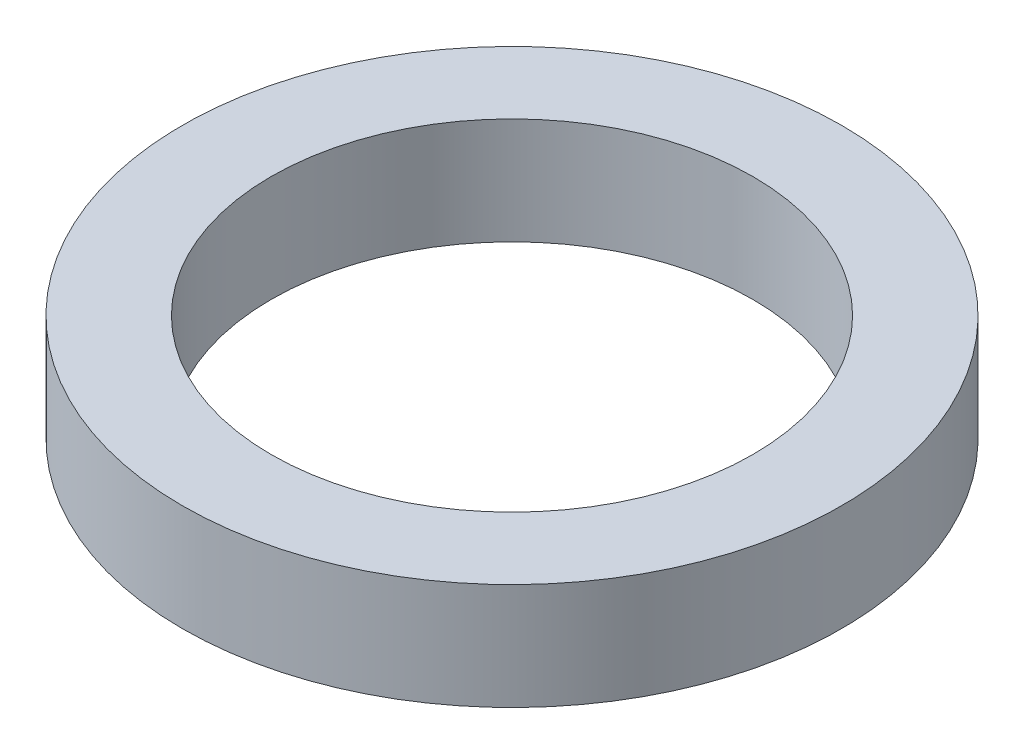
ISO-10303-21;
HEADER;
FILE_DESCRIPTION(('STEP AP214'),'2;1');
FILE_NAME('part.step','',(''),(''),'','','');
FILE_SCHEMA(('AUTOMOTIVE_DESIGN { 1 0 10303 214 1 1 1 1 }'));
ENDSEC;
DATA;
#1=APPLICATION_CONTEXT('core data for automotive mechanical design processes');
#2=APPLICATION_PROTOCOL_DEFINITION('international standard','automotive_design',2000,#1);
#3=PRODUCT_CONTEXT('',#1,'mechanical');
#4=PRODUCT('Part','Part','',(#3));
#5=PRODUCT_RELATED_PRODUCT_CATEGORY('part','',(#4));
#6=PRODUCT_DEFINITION_FORMATION('','',#4);
#7=PRODUCT_DEFINITION_CONTEXT('part definition',#1,'design');
#8=PRODUCT_DEFINITION('design','',#6,#7);
#9=PRODUCT_DEFINITION_SHAPE('','',#8);
#10=(LENGTH_UNIT() NAMED_UNIT(*) SI_UNIT(.MILLI.,.METRE.));
#11=(NAMED_UNIT(*) PLANE_ANGLE_UNIT() SI_UNIT($,.RADIAN.));
#12=(NAMED_UNIT(*) SI_UNIT($,.STERADIAN.) SOLID_ANGLE_UNIT());
#13=UNCERTAINTY_MEASURE_WITH_UNIT(LENGTH_MEASURE(1.E-05),#10,'distance_accuracy_value','');
#14=(GEOMETRIC_REPRESENTATION_CONTEXT(3) GLOBAL_UNCERTAINTY_ASSIGNED_CONTEXT((#13)) GLOBAL_UNIT_ASSIGNED_CONTEXT((#10,
#11,#12)) REPRESENTATION_CONTEXT('',''));
#15=CARTESIAN_POINT('',(0.,0.,0.));
#16=DIRECTION('',(0.,0.,1.));
#17=DIRECTION('',(1.,0.,0.));
#18=AXIS2_PLACEMENT_3D('',#15,#16,#17);
#19=CARTESIAN_POINT('',(0.,21.,0.));
#20=DIRECTION('',(0.,-1.,0.));
#21=DIRECTION('',(0.,0.,-1.));
#22=AXIS2_PLACEMENT_3D('',#19,#20,#21);
#23=CYLINDRICAL_SURFACE('',#22,65.);
#24=CARTESIAN_POINT('',(0.,21.,0.));
#25=DIRECTION('',(0.,1.,0.));
#26=DIRECTION('',(0.,0.,1.));
#27=AXIS2_PLACEMENT_3D('',#24,#25,#26);
#28=CIRCLE('',#27,65.);
#29=CARTESIAN_POINT('',(0.,21.,-65.));
#30=VERTEX_POINT('',#29);
#31=EDGE_CURVE('E10',#30,#30,#28,.T.);
#32=CARTESIAN_POINT('',(0.,0.,0.));
#33=DIRECTION('',(0.,1.,0.));
#34=DIRECTION('',(0.,0.,1.));
#35=AXIS2_PLACEMENT_3D('',#32,#33,#34);
#36=CIRCLE('',#35,65.);
#37=CARTESIAN_POINT('',(0.,0.,-65.));
#38=VERTEX_POINT('',#37);
#39=EDGE_CURVE('E37',#38,#38,#36,.T.);
#40=CARTESIAN_POINT('',(0.,21.,-65.));
#41=CARTESIAN_POINT('',(0.,20.78125,-65.));
#42=CARTESIAN_POINT('',(0.,20.5625,-65.));
#43=CARTESIAN_POINT('',(0.,20.125,-65.));
#44=CARTESIAN_POINT('',(0.,19.90625,-65.));
#45=CARTESIAN_POINT('',(0.,19.46875,-65.));
#46=CARTESIAN_POINT('',(0.,19.25,-65.));
#47=CARTESIAN_POINT('',(0.,18.8125,-65.));
#48=CARTESIAN_POINT('',(0.,18.59375,-65.));
#49=CARTESIAN_POINT('',(0.,18.15625,-65.));
#50=CARTESIAN_POINT('',(0.,17.9375,-65.));
#51=CARTESIAN_POINT('',(0.,17.5,-65.));
#52=CARTESIAN_POINT('',(0.,17.28125,-65.));
#53=CARTESIAN_POINT('',(0.,16.84375,-65.));
#54=CARTESIAN_POINT('',(0.,16.625,-65.));
#55=CARTESIAN_POINT('',(0.,16.1875,-65.));
#56=CARTESIAN_POINT('',(0.,15.96875,-65.));
#57=CARTESIAN_POINT('',(0.,15.53125,-65.));
#58=CARTESIAN_POINT('',(0.,15.3125,-65.));
#59=CARTESIAN_POINT('',(0.,14.875,-65.));
#60=CARTESIAN_POINT('',(0.,14.65625,-65.));
#61=CARTESIAN_POINT('',(0.,14.21875,-65.));
#62=CARTESIAN_POINT('',(0.,14.,-65.));
#63=CARTESIAN_POINT('',(0.,13.5625,-65.));
#64=CARTESIAN_POINT('',(0.,13.34375,-65.));
#65=CARTESIAN_POINT('',(0.,12.90625,-65.));
#66=CARTESIAN_POINT('',(0.,12.6875,-65.));
#67=CARTESIAN_POINT('',(0.,12.25,-65.));
#68=CARTESIAN_POINT('',(0.,12.03125,-65.));
#69=CARTESIAN_POINT('',(0.,11.59375,-65.));
#70=CARTESIAN_POINT('',(0.,11.375,-65.));
#71=CARTESIAN_POINT('',(0.,10.9375,-65.));
#72=CARTESIAN_POINT('',(0.,10.71875,-65.));
#73=CARTESIAN_POINT('',(0.,10.28125,-65.));
#74=CARTESIAN_POINT('',(0.,10.0625,-65.));
#75=CARTESIAN_POINT('',(0.,9.625,-65.));
#76=CARTESIAN_POINT('',(0.,9.40625,-65.));
#77=CARTESIAN_POINT('',(0.,8.96875,-65.));
#78=CARTESIAN_POINT('',(0.,8.75,-65.));
#79=CARTESIAN_POINT('',(0.,8.3125,-65.));
#80=CARTESIAN_POINT('',(0.,8.09375,-65.));
#81=CARTESIAN_POINT('',(0.,7.65625,-65.));
#82=CARTESIAN_POINT('',(0.,7.4375,-65.));
#83=CARTESIAN_POINT('',(0.,7.,-65.));
#84=CARTESIAN_POINT('',(0.,6.78125,-65.));
#85=CARTESIAN_POINT('',(0.,6.34375,-65.));
#86=CARTESIAN_POINT('',(0.,6.125,-65.));
#87=CARTESIAN_POINT('',(0.,5.6875,-65.));
#88=CARTESIAN_POINT('',(0.,5.46875,-65.));
#89=CARTESIAN_POINT('',(0.,5.03125,-65.));
#90=CARTESIAN_POINT('',(0.,4.8125,-65.));
#91=CARTESIAN_POINT('',(0.,4.375,-65.));
#92=CARTESIAN_POINT('',(0.,4.15625,-65.));
#93=CARTESIAN_POINT('',(0.,3.71875,-65.));
#94=CARTESIAN_POINT('',(0.,3.5,-65.));
#95=CARTESIAN_POINT('',(0.,3.0625,-65.));
#96=CARTESIAN_POINT('',(0.,2.84375,-65.));
#97=CARTESIAN_POINT('',(0.,2.40625,-65.));
#98=CARTESIAN_POINT('',(0.,2.1875,-65.));
#99=CARTESIAN_POINT('',(0.,1.75,-65.));
#100=CARTESIAN_POINT('',(0.,1.53125,-65.));
#101=CARTESIAN_POINT('',(0.,1.09375,-65.));
#102=CARTESIAN_POINT('',(0.,0.875000000000001,-65.));
#103=CARTESIAN_POINT('',(0.,0.4375,-65.));
#104=CARTESIAN_POINT('',(0.,0.21875,-65.));
#105=CARTESIAN_POINT('',(0.,0.,-65.));
#106=B_SPLINE_CURVE_WITH_KNOTS('',3,(#40,#41,#42,#43,#44,#45,#46,#47,#48,#49,#50,#51,#52,#53,
#54,#55,#56,#57,#58,#59,#60,#61,#62,#63,#64,#65,#66,#67,#68,#69,#70,#71,#72,#73,#74,#75,#76,#77,
#78,#79,#80,#81,#82,#83,#84,#85,#86,#87,#88,#89,#90,#91,#92,#93,#94,#95,#96,#97,#98,#99,#100,
#101,#102,#103,#104,#105),.UNSPECIFIED.,.F.,.F.,(4,2,2,2,2,2,2,2,2,2,2,2,2,2,2,2,2,2,2,2,2,2,2,
2,2,2,2,2,2,2,2,2,4),(0.,0.656249999999997,1.3125,1.96875,2.625,3.28125,3.9375,4.59375,5.25,
5.90625,6.5625,7.21875,7.875,8.53125,9.1875,9.84375,10.5,11.15625,11.8125,12.46875,13.125,
13.78125,14.4375,15.09375,15.75,16.40625,17.0625,17.71875,18.375,19.03125,19.6875,20.34375,21.),.UNSPECIFIED.);
#107=EDGE_CURVE('BSEAM40',#30,#38,#106,.T.);
#108=ORIENTED_EDGE('',*,*,#31,.F.);
#109=ORIENTED_EDGE('',*,*,#39,.T.);
#110=ORIENTED_EDGE('',*,*,#107,.T.);
#111=ORIENTED_EDGE('',*,*,#107,.F.);
#112=EDGE_LOOP('',(#108,#110,#109,#111));
#113=FACE_BOUND('',#112,.T.);
#114=ADVANCED_FACE('F40',(#113),#23,.T.);
#115=CARTESIAN_POINT('',(0.,21.,0.));
#116=DIRECTION('',(0.,1.,0.));
#117=DIRECTION('',(0.,0.,1.));
#118=AXIS2_PLACEMENT_3D('',#115,#116,#117);
#119=PLANE('',#118);
#120=CARTESIAN_POINT('',(0.,21.,0.));
#121=DIRECTION('',(0.,1.,0.));
#122=DIRECTION('',(0.,0.,1.));
#123=AXIS2_PLACEMENT_3D('',#120,#121,#122);
#124=CIRCLE('',#123,47.5);
#125=CARTESIAN_POINT('',(0.,21.,-47.5));
#126=VERTEX_POINT('',#125);
#127=EDGE_CURVE('E50',#126,#126,#124,.T.);
#128=ORIENTED_EDGE('',*,*,#127,.F.);
#129=EDGE_LOOP('',(#128));
#130=FACE_BOUND('',#129,.T.);
#131=ORIENTED_EDGE('',*,*,#31,.T.);
#132=EDGE_LOOP('',(#131));
#133=FACE_BOUND('',#132,.T.);
#134=ADVANCED_FACE('F59',(#130,#133),#119,.T.);
#135=CARTESIAN_POINT('',(0.,0.,0.));
#136=DIRECTION('',(0.,1.,0.));
#137=DIRECTION('',(0.,0.,1.));
#138=AXIS2_PLACEMENT_3D('',#135,#136,#137);
#139=PLANE('',#138);
#140=CARTESIAN_POINT('',(0.,0.,0.));
#141=DIRECTION('',(0.,1.,0.));
#142=DIRECTION('',(0.,0.,1.));
#143=AXIS2_PLACEMENT_3D('',#140,#141,#142);
#144=CIRCLE('',#143,47.5);
#145=CARTESIAN_POINT('',(0.,0.,-47.5));
#146=VERTEX_POINT('',#145);
#147=EDGE_CURVE('E47',#146,#146,#144,.T.);
#148=ORIENTED_EDGE('',*,*,#147,.T.);
#149=EDGE_LOOP('',(#148));
#150=FACE_BOUND('',#149,.T.);
#151=ORIENTED_EDGE('',*,*,#39,.F.);
#152=EDGE_LOOP('',(#151));
#153=FACE_BOUND('',#152,.T.);
#154=ADVANCED_FACE('F58',(#150,#153),#139,.F.);
#155=CARTESIAN_POINT('',(0.,21.,0.));
#156=DIRECTION('',(0.,-1.,0.));
#157=DIRECTION('',(0.,0.,-1.));
#158=AXIS2_PLACEMENT_3D('',#155,#156,#157);
#159=CYLINDRICAL_SURFACE('',#158,47.5);
#160=CARTESIAN_POINT('',(0.,21.,-47.5));
#161=CARTESIAN_POINT('',(0.,20.78125,-47.5));
#162=CARTESIAN_POINT('',(0.,20.5625,-47.5));
#163=CARTESIAN_POINT('',(0.,20.125,-47.5));
#164=CARTESIAN_POINT('',(0.,19.90625,-47.5));
#165=CARTESIAN_POINT('',(0.,19.46875,-47.5));
#166=CARTESIAN_POINT('',(0.,19.25,-47.5));
#167=CARTESIAN_POINT('',(0.,18.8125,-47.5));
#168=CARTESIAN_POINT('',(0.,18.59375,-47.5));
#169=CARTESIAN_POINT('',(0.,18.15625,-47.5));
#170=CARTESIAN_POINT('',(0.,17.9375,-47.5));
#171=CARTESIAN_POINT('',(0.,17.5,-47.5));
#172=CARTESIAN_POINT('',(0.,17.28125,-47.5));
#173=CARTESIAN_POINT('',(0.,16.84375,-47.5));
#174=CARTESIAN_POINT('',(0.,16.625,-47.5));
#175=CARTESIAN_POINT('',(0.,16.1875,-47.5));
#176=CARTESIAN_POINT('',(0.,15.96875,-47.5));
#177=CARTESIAN_POINT('',(0.,15.53125,-47.5));
#178=CARTESIAN_POINT('',(0.,15.3125,-47.5));
#179=CARTESIAN_POINT('',(0.,14.875,-47.5));
#180=CARTESIAN_POINT('',(0.,14.65625,-47.5));
#181=CARTESIAN_POINT('',(0.,14.21875,-47.5));
#182=CARTESIAN_POINT('',(0.,14.,-47.5));
#183=CARTESIAN_POINT('',(0.,13.5625,-47.5));
#184=CARTESIAN_POINT('',(0.,13.34375,-47.5));
#185=CARTESIAN_POINT('',(0.,12.90625,-47.5));
#186=CARTESIAN_POINT('',(0.,12.6875,-47.5));
#187=CARTESIAN_POINT('',(0.,12.25,-47.5));
#188=CARTESIAN_POINT('',(0.,12.03125,-47.5));
#189=CARTESIAN_POINT('',(0.,11.59375,-47.5));
#190=CARTESIAN_POINT('',(0.,11.375,-47.5));
#191=CARTESIAN_POINT('',(0.,10.9375,-47.5));
#192=CARTESIAN_POINT('',(0.,10.71875,-47.5));
#193=CARTESIAN_POINT('',(0.,10.28125,-47.5));
#194=CARTESIAN_POINT('',(0.,10.0625,-47.5));
#195=CARTESIAN_POINT('',(0.,9.625,-47.5));
#196=CARTESIAN_POINT('',(0.,9.40625,-47.5));
#197=CARTESIAN_POINT('',(0.,8.96875,-47.5));
#198=CARTESIAN_POINT('',(0.,8.75,-47.5));
#199=CARTESIAN_POINT('',(0.,8.3125,-47.5));
#200=CARTESIAN_POINT('',(0.,8.09375,-47.5));
#201=CARTESIAN_POINT('',(0.,7.65625,-47.5));
#202=CARTESIAN_POINT('',(0.,7.4375,-47.5));
#203=CARTESIAN_POINT('',(0.,7.,-47.5));
#204=CARTESIAN_POINT('',(0.,6.78125,-47.5));
#205=CARTESIAN_POINT('',(0.,6.34375,-47.5));
#206=CARTESIAN_POINT('',(0.,6.125,-47.5));
#207=CARTESIAN_POINT('',(0.,5.6875,-47.5));
#208=CARTESIAN_POINT('',(0.,5.46875,-47.5));
#209=CARTESIAN_POINT('',(0.,5.03125,-47.5));
#210=CARTESIAN_POINT('',(0.,4.8125,-47.5));
#211=CARTESIAN_POINT('',(0.,4.375,-47.5));
#212=CARTESIAN_POINT('',(0.,4.15625,-47.5));
#213=CARTESIAN_POINT('',(0.,3.71875,-47.5));
#214=CARTESIAN_POINT('',(0.,3.5,-47.5));
#215=CARTESIAN_POINT('',(0.,3.0625,-47.5));
#216=CARTESIAN_POINT('',(0.,2.84375,-47.5));
#217=CARTESIAN_POINT('',(0.,2.40625,-47.5));
#218=CARTESIAN_POINT('',(0.,2.1875,-47.5));
#219=CARTESIAN_POINT('',(0.,1.75,-47.5));
#220=CARTESIAN_POINT('',(0.,1.53125,-47.5));
#221=CARTESIAN_POINT('',(0.,1.09375,-47.5));
#222=CARTESIAN_POINT('',(0.,0.875000000000001,-47.5));
#223=CARTESIAN_POINT('',(0.,0.4375,-47.5));
#224=CARTESIAN_POINT('',(0.,0.21875,-47.5));
#225=CARTESIAN_POINT('',(0.,0.,-47.5));
#226=B_SPLINE_CURVE_WITH_KNOTS('',3,(#160,#161,#162,#163,#164,#165,#166,#167,#168,#169,#170,
#171,#172,#173,#174,#175,#176,#177,#178,#179,#180,#181,#182,#183,#184,#185,#186,#187,#188,#189,
#190,#191,#192,#193,#194,#195,#196,#197,#198,#199,#200,#201,#202,#203,#204,#205,#206,#207,#208,
#209,#210,#211,#212,#213,#214,#215,#216,#217,#218,#219,#220,#221,#222,#223,#224,#225),
.UNSPECIFIED.,.F.,.F.,(4,2,2,2,2,2,2,2,2,2,2,2,2,2,2,2,2,2,2,2,2,2,2,2,2,2,2,2,2,2,2,2,4),(0.,
0.656249999999997,1.3125,1.96875,2.625,3.28125,3.9375,4.59375,5.25,5.90625,6.5625,7.21875,7.875,
8.53125,9.1875,9.84375,10.5,11.15625,11.8125,12.46875,13.125,13.78125,14.4375,15.09375,15.75,
16.40625,17.0625,17.71875,18.375,19.03125,19.6875,20.34375,21.),.UNSPECIFIED.);
#227=EDGE_CURVE('BSEAM54',#126,#146,#226,.T.);
#228=ORIENTED_EDGE('',*,*,#127,.T.);
#229=ORIENTED_EDGE('',*,*,#147,.F.);
#230=ORIENTED_EDGE('',*,*,#227,.T.);
#231=ORIENTED_EDGE('',*,*,#227,.F.);
#232=EDGE_LOOP('',(#228,#230,#229,#231));
#233=FACE_BOUND('',#232,.T.);
#234=ADVANCED_FACE('F54',(#233),#159,.F.);
#235=CLOSED_SHELL('',(#114,#134,#154,#234));
#236=MANIFOLD_SOLID_BREP('B2',#235);
#237=ADVANCED_BREP_SHAPE_REPRESENTATION('',(#18,#236),#14);
#238=SHAPE_DEFINITION_REPRESENTATION(#9,#237);
ENDSEC;
END-ISO-10303-21;
